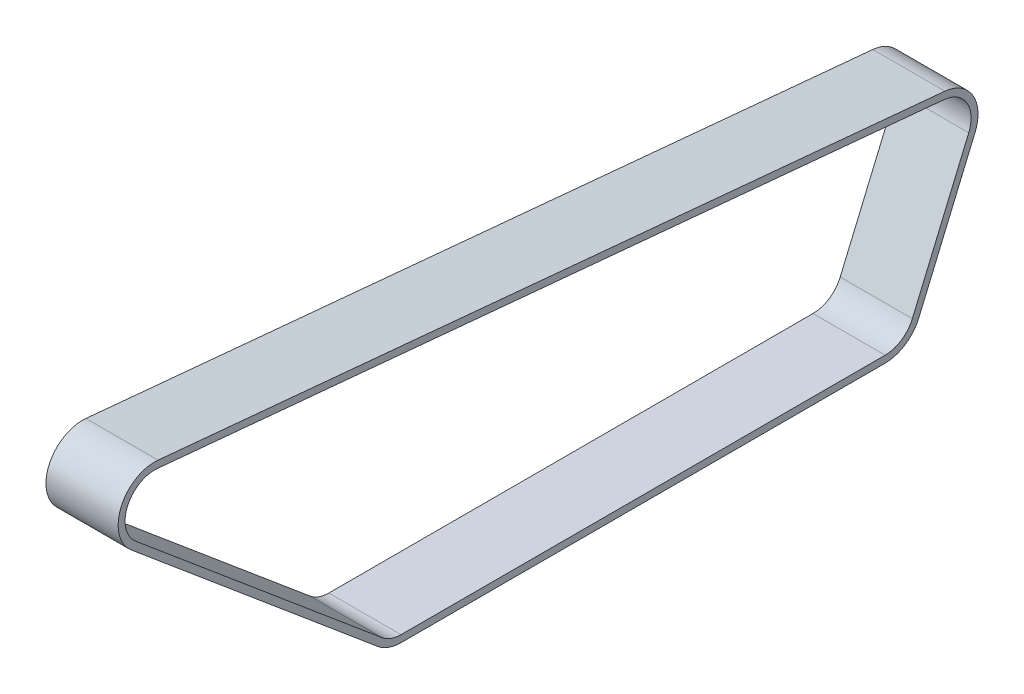
ISO-10303-21;
HEADER;
FILE_DESCRIPTION(('STEP AP214'),'2;1');
FILE_NAME('part.step','',(''),(''),'','','');
FILE_SCHEMA(('AUTOMOTIVE_DESIGN { 1 0 10303 214 1 1 1 1 }'));
ENDSEC;
DATA;
#1=APPLICATION_CONTEXT('core data for automotive mechanical design processes');
#2=APPLICATION_PROTOCOL_DEFINITION('international standard','automotive_design',2000,#1);
#3=PRODUCT_CONTEXT('',#1,'mechanical');
#4=PRODUCT('Part','Part','',(#3));
#5=PRODUCT_RELATED_PRODUCT_CATEGORY('part','',(#4));
#6=PRODUCT_DEFINITION_FORMATION('','',#4);
#7=PRODUCT_DEFINITION_CONTEXT('part definition',#1,'design');
#8=PRODUCT_DEFINITION('design','',#6,#7);
#9=PRODUCT_DEFINITION_SHAPE('','',#8);
#10=(LENGTH_UNIT() NAMED_UNIT(*) SI_UNIT(.MILLI.,.METRE.));
#11=(NAMED_UNIT(*) PLANE_ANGLE_UNIT() SI_UNIT($,.RADIAN.));
#12=(NAMED_UNIT(*) SI_UNIT($,.STERADIAN.) SOLID_ANGLE_UNIT());
#13=UNCERTAINTY_MEASURE_WITH_UNIT(LENGTH_MEASURE(1.E-05),#10,'distance_accuracy_value','');
#14=(GEOMETRIC_REPRESENTATION_CONTEXT(3) GLOBAL_UNCERTAINTY_ASSIGNED_CONTEXT((#13)) GLOBAL_UNIT_ASSIGNED_CONTEXT((#10,
#11,#12)) REPRESENTATION_CONTEXT('',''));
#15=CARTESIAN_POINT('',(0.,0.,0.));
#16=DIRECTION('',(0.,0.,1.));
#17=DIRECTION('',(1.,0.,0.));
#18=AXIS2_PLACEMENT_3D('',#15,#16,#17);
#19=CARTESIAN_POINT('',(3.,21.,132.35662508041));
#20=DIRECTION('',(-1.,0.,0.));
#21=DIRECTION('',(0.,0.,1.));
#22=AXIS2_PLACEMENT_3D('',#19,#20,#21);
#23=CYLINDRICAL_SURFACE('',#22,21.);
#24=CARTESIAN_POINT('',(0.,21.,132.35662508041));
#25=DIRECTION('',(1.,0.,0.));
#26=DIRECTION('',(0.,0.,1.));
#27=AXIS2_PLACEMENT_3D('',#24,#25,#26);
#28=CIRCLE('',#27,21.);
#29=CARTESIAN_POINT('',(0.,4.91306669450143,145.855164883827));
#30=VERTEX_POINT('',#29);
#31=CARTESIAN_POINT('',(0.,0.,132.35662508041));
#32=VERTEX_POINT('',#31);
#33=EDGE_CURVE('E238',#30,#32,#28,.T.);
#34=ORIENTED_EDGE('',*,*,#33,.T.);
#35=DIRECTION('',(-1.,0.,0.));
#36=VECTOR('',#35,1.);
#37=CARTESIAN_POINT('',(3.,0.,132.35662508041));
#38=LINE('',#37,#36);
#39=CARTESIAN_POINT('',(41.5,0.,132.35662508041));
#40=VERTEX_POINT('',#39);
#41=EDGE_CURVE('E11',#40,#32,#38,.T.);
#42=ORIENTED_EDGE('',*,*,#41,.F.);
#43=CARTESIAN_POINT('',(41.5,21.0000000000001,132.35662508041));
#44=DIRECTION('',(1.,0.,0.));
#45=DIRECTION('',(0.,0.,-1.));
#46=AXIS2_PLACEMENT_3D('',#43,#44,#45);
#47=CIRCLE('',#46,21.0000000000001);
#48=CARTESIAN_POINT('',(41.5,4.91306669450144,145.855164883827));
#49=VERTEX_POINT('',#48);
#50=EDGE_CURVE('E220',#49,#40,#47,.T.);
#51=ORIENTED_EDGE('',*,*,#50,.F.);
#52=DIRECTION('',(-1.,0.,0.));
#53=VECTOR('',#52,1.);
#54=CARTESIAN_POINT('',(3.,4.91306669450143,145.855164883827));
#55=LINE('',#54,#53);
#56=EDGE_CURVE('E254',#49,#30,#55,.T.);
#57=ORIENTED_EDGE('',*,*,#56,.T.);
#58=EDGE_LOOP('',(#34,#42,#51,#57));
#59=FACE_BOUND('',#58,.T.);
#60=ADVANCED_FACE('F34',(#59),#23,.T.);
#61=CARTESIAN_POINT('',(3.,0.,132.35662508041));
#62=DIRECTION('',(0.,1.,0.));
#63=DIRECTION('',(0.,0.,1.));
#64=AXIS2_PLACEMENT_3D('',#61,#62,#63);
#65=PLANE('',#64);
#66=DIRECTION('',(0.,0.,-1.));
#67=VECTOR('',#66,1.);
#68=CARTESIAN_POINT('',(0.,0.,132.35662508041));
#69=LINE('',#68,#67);
#70=CARTESIAN_POINT('',(0.,0.,-146.10040321489));
#71=VERTEX_POINT('',#70);
#72=EDGE_CURVE('E241',#32,#71,#69,.T.);
#73=ORIENTED_EDGE('',*,*,#72,.T.);
#74=DIRECTION('',(-1.,0.,0.));
#75=VECTOR('',#74,1.);
#76=CARTESIAN_POINT('',(3.,0.,-146.10040321489));
#77=LINE('',#76,#75);
#78=CARTESIAN_POINT('',(41.5,0.,-146.10040321489));
#79=VERTEX_POINT('',#78);
#80=EDGE_CURVE('E41',#79,#71,#77,.T.);
#81=ORIENTED_EDGE('',*,*,#80,.F.);
#82=DIRECTION('',(0.,0.,-1.));
#83=VECTOR('',#82,1.);
#84=CARTESIAN_POINT('',(41.5,0.,-146.10040321489));
#85=LINE('',#84,#83);
#86=EDGE_CURVE('E223',#40,#79,#85,.T.);
#87=ORIENTED_EDGE('',*,*,#86,.F.);
#88=ORIENTED_EDGE('',*,*,#41,.T.);
#89=EDGE_LOOP('',(#73,#81,#87,#88));
#90=FACE_BOUND('',#89,.T.);
#91=ADVANCED_FACE('F300',(#90),#65,.F.);
#92=CARTESIAN_POINT('',(3.,21.,-146.10040321489));
#93=DIRECTION('',(-1.,0.,0.));
#94=DIRECTION('',(0.,0.,1.));
#95=AXIS2_PLACEMENT_3D('',#92,#93,#94);
#96=CYLINDRICAL_SURFACE('',#95,21.);
#97=CARTESIAN_POINT('',(0.,21.,-146.10040321489));
#98=DIRECTION('',(1.,0.,0.));
#99=DIRECTION('',(0.,0.,-1.));
#100=AXIS2_PLACEMENT_3D('',#97,#98,#99);
#101=CIRCLE('',#100,21.);
#102=CARTESIAN_POINT('',(0.,12.7946463017253,-165.431005137392));
#103=VERTEX_POINT('',#102);
#104=EDGE_CURVE('E243',#71,#103,#101,.T.);
#105=ORIENTED_EDGE('',*,*,#104,.T.);
#106=DIRECTION('',(-1.,0.,0.));
#107=VECTOR('',#106,1.);
#108=CARTESIAN_POINT('',(3.,12.7946463017253,-165.431005137392));
#109=LINE('',#108,#107);
#110=CARTESIAN_POINT('',(41.5,12.7946463017253,-165.431005137392));
#111=VERTEX_POINT('',#110);
#112=EDGE_CURVE('E267',#111,#103,#109,.T.);
#113=ORIENTED_EDGE('',*,*,#112,.F.);
#114=CARTESIAN_POINT('',(41.5,21.,-146.10040321489));
#115=DIRECTION('',(1.,0.,0.));
#116=DIRECTION('',(0.,0.,1.));
#117=AXIS2_PLACEMENT_3D('',#114,#115,#116);
#118=CIRCLE('',#117,21.);
#119=EDGE_CURVE('E226',#79,#111,#118,.T.);
#120=ORIENTED_EDGE('',*,*,#119,.F.);
#121=ORIENTED_EDGE('',*,*,#80,.T.);
#122=EDGE_LOOP('',(#105,#113,#120,#121));
#123=FACE_BOUND('',#122,.T.);
#124=ADVANCED_FACE('F273',(#123),#96,.T.);
#125=CARTESIAN_POINT('',(3.,12.7946463017253,-165.431005137392));
#126=DIRECTION('',(0.,0.390731128489271,0.920504853452441));
#127=DIRECTION('',(0.,-0.920504853452441,0.390731128489271));
#128=AXIS2_PLACEMENT_3D('',#125,#126,#127);
#129=PLANE('',#128);
#130=DIRECTION('',(0.,0.920504853452441,-0.390731128489271));
#131=VECTOR('',#130,1.);
#132=CARTESIAN_POINT('',(0.,12.7946463017253,-165.431005137392));
#133=LINE('',#132,#131);
#134=CARTESIAN_POINT('',(0.,89.1965491382779,-197.861688802001));
#135=VERTEX_POINT('',#134);
#136=EDGE_CURVE('E245',#103,#135,#133,.T.);
#137=ORIENTED_EDGE('',*,*,#136,.T.);
#138=DIRECTION('',(-1.,0.,0.));
#139=VECTOR('',#138,1.);
#140=CARTESIAN_POINT('',(3.,89.1965491382779,-197.861688802001));
#141=LINE('',#140,#139);
#142=CARTESIAN_POINT('',(41.5,89.196549138278,-197.861688802001));
#143=VERTEX_POINT('',#142);
#144=EDGE_CURVE('E264',#143,#135,#141,.T.);
#145=ORIENTED_EDGE('',*,*,#144,.F.);
#146=DIRECTION('',(0.,0.920504853452441,-0.390731128489271));
#147=VECTOR('',#146,1.);
#148=CARTESIAN_POINT('',(41.5,89.1965491382779,-197.861688802001));
#149=LINE('',#148,#147);
#150=EDGE_CURVE('E229',#111,#143,#149,.T.);
#151=ORIENTED_EDGE('',*,*,#150,.F.);
#152=ORIENTED_EDGE('',*,*,#112,.T.);
#153=EDGE_LOOP('',(#137,#145,#151,#152));
#154=FACE_BOUND('',#153,.T.);
#155=ADVANCED_FACE('F281',(#154),#129,.F.);
#156=CARTESIAN_POINT('',(3.,97.4019028365527,-178.5310868795));
#157=DIRECTION('',(-1.,0.,0.));
#158=DIRECTION('',(0.,0.,1.));
#159=AXIS2_PLACEMENT_3D('',#156,#157,#158);
#160=CYLINDRICAL_SURFACE('',#159,21.);
#161=CARTESIAN_POINT('',(0.,97.4019028365527,-178.5310868795));
#162=DIRECTION('',(1.,0.,0.));
#163=DIRECTION('',(0.,0.,-1.));
#164=AXIS2_PLACEMENT_3D('',#161,#162,#163);
#165=CIRCLE('',#164,21.);
#166=CARTESIAN_POINT('',(0.,118.309861650224,-180.495077267927));
#167=VERTEX_POINT('',#166);
#168=EDGE_CURVE('E247',#135,#167,#165,.T.);
#169=ORIENTED_EDGE('',*,*,#168,.T.);
#170=DIRECTION('',(-1.,0.,0.));
#171=VECTOR('',#170,1.);
#172=CARTESIAN_POINT('',(3.,118.309861650224,-180.495077267927));
#173=LINE('',#172,#171);
#174=CARTESIAN_POINT('',(41.5,118.309861650224,-180.495077267927));
#175=VERTEX_POINT('',#174);
#176=EDGE_CURVE('E261',#175,#167,#173,.T.);
#177=ORIENTED_EDGE('',*,*,#176,.F.);
#178=CARTESIAN_POINT('',(41.5,97.4019028365526,-178.5310868795));
#179=DIRECTION('',(1.,0.,0.));
#180=DIRECTION('',(0.,0.,1.));
#181=AXIS2_PLACEMENT_3D('',#178,#179,#180);
#182=CIRCLE('',#181,21.);
#183=EDGE_CURVE('E232',#143,#175,#182,.T.);
#184=ORIENTED_EDGE('',*,*,#183,.F.);
#185=ORIENTED_EDGE('',*,*,#144,.T.);
#186=EDGE_LOOP('',(#169,#177,#184,#185));
#187=FACE_BOUND('',#186,.T.);
#188=ADVANCED_FACE('F285',(#187),#160,.T.);
#189=CARTESIAN_POINT('',(3.,160.825649707406,272.113220037601));
#190=DIRECTION('',(0.,-0.99561708636529,0.0935233518298539));
#191=DIRECTION('',(0.,-0.093523351829854,-0.99561708636529));
#192=AXIS2_PLACEMENT_3D('',#189,#190,#191);
#193=PLANE('',#192);
#194=DIRECTION('',(0.,0.093523351829854,0.99561708636529));
#195=VECTOR('',#194,1.);
#196=CARTESIAN_POINT('',(0.,160.825649707406,272.113220037601));
#197=LINE('',#196,#195);
#198=CARTESIAN_POINT('',(0.,160.825649707406,272.113220037601));
#199=VERTEX_POINT('',#198);
#200=EDGE_CURVE('E249',#167,#199,#197,.T.);
#201=ORIENTED_EDGE('',*,*,#200,.T.);
#202=DIRECTION('',(-1.,0.,0.));
#203=VECTOR('',#202,1.);
#204=CARTESIAN_POINT('',(3.,160.825649707406,272.113220037601));
#205=LINE('',#204,#203);
#206=CARTESIAN_POINT('',(41.5,160.825649707406,272.113220037601));
#207=VERTEX_POINT('',#206);
#208=EDGE_CURVE('E258',#207,#199,#205,.T.);
#209=ORIENTED_EDGE('',*,*,#208,.F.);
#210=DIRECTION('',(0.,0.093523351829854,0.99561708636529));
#211=VECTOR('',#210,1.);
#212=CARTESIAN_POINT('',(41.5,160.825649707406,272.113220037601));
#213=LINE('',#212,#211);
#214=EDGE_CURVE('E235',#175,#207,#213,.T.);
#215=ORIENTED_EDGE('',*,*,#214,.F.);
#216=ORIENTED_EDGE('',*,*,#176,.T.);
#217=EDGE_LOOP('',(#201,#209,#215,#216));
#218=FACE_BOUND('',#217,.T.);
#219=ADVANCED_FACE('F292',(#218),#193,.F.);
#220=CARTESIAN_POINT('',(3.,139.917690893735,274.077210426028));
#221=DIRECTION('',(-1.,0.,0.));
#222=DIRECTION('',(0.,0.,1.));
#223=AXIS2_PLACEMENT_3D('',#220,#221,#222);
#224=CYLINDRICAL_SURFACE('',#223,21.);
#225=CARTESIAN_POINT('',(0.,139.917690893735,274.077210426028));
#226=DIRECTION('',(1.,0.,0.));
#227=DIRECTION('',(0.,0.,1.));
#228=AXIS2_PLACEMENT_3D('',#225,#226,#227);
#229=CIRCLE('',#228,21.);
#230=CARTESIAN_POINT('',(0.,123.830757588236,287.575750229445));
#231=VERTEX_POINT('',#230);
#232=EDGE_CURVE('E251',#199,#231,#229,.T.);
#233=ORIENTED_EDGE('',*,*,#232,.T.);
#234=DIRECTION('',(-1.,0.,0.));
#235=VECTOR('',#234,1.);
#236=CARTESIAN_POINT('',(3.,123.830757588236,287.575750229445));
#237=LINE('',#236,#235);
#238=CARTESIAN_POINT('',(41.5,123.830757588236,287.575750229445));
#239=VERTEX_POINT('',#238);
#240=EDGE_CURVE('E256',#239,#231,#237,.T.);
#241=ORIENTED_EDGE('',*,*,#240,.F.);
#242=CARTESIAN_POINT('',(41.5,139.917690893735,274.077210426028));
#243=DIRECTION('',(1.,0.,0.));
#244=DIRECTION('',(0.,0.,1.));
#245=AXIS2_PLACEMENT_3D('',#242,#243,#244);
#246=CIRCLE('',#245,21.);
#247=EDGE_CURVE('E157',#207,#239,#246,.T.);
#248=ORIENTED_EDGE('',*,*,#247,.F.);
#249=ORIENTED_EDGE('',*,*,#208,.T.);
#250=EDGE_LOOP('',(#233,#241,#248,#249));
#251=FACE_BOUND('',#250,.T.);
#252=ADVANCED_FACE('F295',(#251),#224,.T.);
#253=CARTESIAN_POINT('',(3.,4.91306669450143,145.855164883827));
#254=DIRECTION('',(0.,0.766044443118982,-0.642787609686534));
#255=DIRECTION('',(0.,0.642787609686534,0.766044443118982));
#256=AXIS2_PLACEMENT_3D('',#253,#254,#255);
#257=PLANE('',#256);
#258=DIRECTION('',(0.,-0.642787609686534,-0.766044443118982));
#259=VECTOR('',#258,1.);
#260=CARTESIAN_POINT('',(0.,4.91306669450143,145.855164883827));
#261=LINE('',#260,#259);
#262=EDGE_CURVE('E56',#231,#30,#261,.T.);
#263=ORIENTED_EDGE('',*,*,#262,.T.);
#264=ORIENTED_EDGE('',*,*,#56,.F.);
#265=DIRECTION('',(0.,-0.642787609686534,-0.766044443118982));
#266=VECTOR('',#265,1.);
#267=CARTESIAN_POINT('',(41.5,4.91306669450143,145.855164883827));
#268=LINE('',#267,#266);
#269=EDGE_CURVE('E217',#239,#49,#268,.T.);
#270=ORIENTED_EDGE('',*,*,#269,.F.);
#271=ORIENTED_EDGE('',*,*,#240,.T.);
#272=EDGE_LOOP('',(#263,#264,#270,#271));
#273=FACE_BOUND('',#272,.T.);
#274=ADVANCED_FACE('F299',(#273),#257,.F.);
#275=CARTESIAN_POINT('',(0.,21.,132.35662508041));
#276=DIRECTION('',(-1.,0.,0.));
#277=DIRECTION('',(0.,0.,1.));
#278=AXIS2_PLACEMENT_3D('',#275,#276,#277);
#279=PLANE('',#278);
#280=CARTESIAN_POINT('',(0.,139.917690893735,274.077210426028));
#281=DIRECTION('',(1.,0.,0.));
#282=DIRECTION('',(0.,0.,1.));
#283=AXIS2_PLACEMENT_3D('',#280,#281,#282);
#284=CIRCLE('',#283,17.);
#285=CARTESIAN_POINT('',(0.,156.843181361945,272.487313444921));
#286=VERTEX_POINT('',#285);
#287=CARTESIAN_POINT('',(0.,126.894935360712,285.004599790699));
#288=VERTEX_POINT('',#287);
#289=EDGE_CURVE('E152',#286,#288,#284,.T.);
#290=ORIENTED_EDGE('',*,*,#289,.T.);
#291=DIRECTION('',(0.,-0.642787609686534,-0.766044443118982));
#292=VECTOR('',#291,1.);
#293=CARTESIAN_POINT('',(0.,7.97724446697736,143.284014445081));
#294=LINE('',#293,#292);
#295=CARTESIAN_POINT('',(0.,7.97724446697737,143.284014445081));
#296=VERTEX_POINT('',#295);
#297=EDGE_CURVE('E160',#288,#296,#294,.T.);
#298=ORIENTED_EDGE('',*,*,#297,.T.);
#299=CARTESIAN_POINT('',(0.,21.0000000000002,132.35662508041));
#300=DIRECTION('',(1.,0.,0.));
#301=DIRECTION('',(0.,0.,-1.));
#302=AXIS2_PLACEMENT_3D('',#299,#300,#301);
#303=CIRCLE('',#302,17.0000000000002);
#304=CARTESIAN_POINT('',(0.,4.,132.35662508041));
#305=VERTEX_POINT('',#304);
#306=EDGE_CURVE('E164',#296,#305,#303,.T.);
#307=ORIENTED_EDGE('',*,*,#306,.T.);
#308=DIRECTION('',(0.,0.,-1.));
#309=VECTOR('',#308,1.);
#310=CARTESIAN_POINT('',(0.,4.,-146.10040321489));
#311=LINE('',#310,#309);
#312=CARTESIAN_POINT('',(0.,4.,-146.10040321489));
#313=VERTEX_POINT('',#312);
#314=EDGE_CURVE('E174',#305,#313,#311,.T.);
#315=ORIENTED_EDGE('',*,*,#314,.T.);
#316=CARTESIAN_POINT('',(0.,21.,-146.10040321489));
#317=DIRECTION('',(1.,0.,0.));
#318=DIRECTION('',(0.,0.,1.));
#319=AXIS2_PLACEMENT_3D('',#316,#317,#318);
#320=CIRCLE('',#319,17.);
#321=CARTESIAN_POINT('',(0.,14.3575708156824,-161.748985723582));
#322=VERTEX_POINT('',#321);
#323=EDGE_CURVE('E177',#313,#322,#320,.T.);
#324=ORIENTED_EDGE('',*,*,#323,.T.);
#325=DIRECTION('',(0.,0.920504853452441,-0.390731128489271));
#326=VECTOR('',#325,1.);
#327=CARTESIAN_POINT('',(0.,90.759473652235,-194.179669388191));
#328=LINE('',#327,#326);
#329=CARTESIAN_POINT('',(0.,90.759473652235,-194.179669388191));
#330=VERTEX_POINT('',#329);
#331=EDGE_CURVE('E180',#322,#330,#328,.T.);
#332=ORIENTED_EDGE('',*,*,#331,.T.);
#333=CARTESIAN_POINT('',(0.,97.4019028365527,-178.5310868795));
#334=DIRECTION('',(1.,0.,0.));
#335=DIRECTION('',(0.,0.,1.));
#336=AXIS2_PLACEMENT_3D('',#333,#334,#335);
#337=CIRCLE('',#336,17.);
#338=CARTESIAN_POINT('',(0.,114.327393304763,-180.120983860608));
#339=VERTEX_POINT('',#338);
#340=EDGE_CURVE('E183',#330,#339,#337,.T.);
#341=ORIENTED_EDGE('',*,*,#340,.T.);
#342=DIRECTION('',(0.,0.093523351829854,0.99561708636529));
#343=VECTOR('',#342,1.);
#344=CARTESIAN_POINT('',(0.,156.843181361945,272.487313444921));
#345=LINE('',#344,#343);
#346=EDGE_CURVE('E170',#339,#286,#345,.T.);
#347=ORIENTED_EDGE('',*,*,#346,.T.);
#348=EDGE_LOOP('',(#290,#298,#307,#315,#324,#332,#341,#347));
#349=FACE_BOUND('',#348,.T.);
#350=ORIENTED_EDGE('',*,*,#33,.F.);
#351=ORIENTED_EDGE('',*,*,#262,.F.);
#352=ORIENTED_EDGE('',*,*,#232,.F.);
#353=ORIENTED_EDGE('',*,*,#200,.F.);
#354=ORIENTED_EDGE('',*,*,#168,.F.);
#355=ORIENTED_EDGE('',*,*,#136,.F.);
#356=ORIENTED_EDGE('',*,*,#104,.F.);
#357=ORIENTED_EDGE('',*,*,#72,.F.);
#358=EDGE_LOOP('',(#350,#351,#352,#353,#354,#355,#356,#357));
#359=FACE_BOUND('',#358,.T.);
#360=ADVANCED_FACE('F166',(#349,#359),#279,.T.);
#361=CARTESIAN_POINT('',(41.5,139.917690893735,274.077210426028));
#362=DIRECTION('',(-1.,0.,0.));
#363=DIRECTION('',(0.,0.,1.));
#364=AXIS2_PLACEMENT_3D('',#361,#362,#363);
#365=PLANE('',#364);
#366=ORIENTED_EDGE('',*,*,#247,.T.);
#367=ORIENTED_EDGE('',*,*,#269,.T.);
#368=ORIENTED_EDGE('',*,*,#50,.T.);
#369=ORIENTED_EDGE('',*,*,#86,.T.);
#370=ORIENTED_EDGE('',*,*,#119,.T.);
#371=ORIENTED_EDGE('',*,*,#150,.T.);
#372=ORIENTED_EDGE('',*,*,#183,.T.);
#373=ORIENTED_EDGE('',*,*,#214,.T.);
#374=EDGE_LOOP('',(#366,#367,#368,#369,#370,#371,#372,#373));
#375=FACE_BOUND('',#374,.T.);
#376=CARTESIAN_POINT('',(41.5,139.917690893735,274.077210426028));
#377=DIRECTION('',(1.,0.,0.));
#378=DIRECTION('',(0.,0.,1.));
#379=AXIS2_PLACEMENT_3D('',#376,#377,#378);
#380=CIRCLE('',#379,17.);
#381=CARTESIAN_POINT('',(41.5,156.843181361945,272.487313444921));
#382=VERTEX_POINT('',#381);
#383=CARTESIAN_POINT('',(41.5,126.894935360712,285.004599790699));
#384=VERTEX_POINT('',#383);
#385=EDGE_CURVE('E155',#382,#384,#380,.T.);
#386=ORIENTED_EDGE('',*,*,#385,.F.);
#387=DIRECTION('',(0.,0.093523351829854,0.99561708636529));
#388=VECTOR('',#387,1.);
#389=CARTESIAN_POINT('',(41.5,156.843181361945,272.487313444921));
#390=LINE('',#389,#388);
#391=CARTESIAN_POINT('',(41.5,114.327393304763,-180.120983860608));
#392=VERTEX_POINT('',#391);
#393=EDGE_CURVE('E200',#392,#382,#390,.T.);
#394=ORIENTED_EDGE('',*,*,#393,.F.);
#395=CARTESIAN_POINT('',(41.5,97.4019028365526,-178.5310868795));
#396=DIRECTION('',(1.,0.,0.));
#397=DIRECTION('',(0.,0.,1.));
#398=AXIS2_PLACEMENT_3D('',#395,#396,#397);
#399=CIRCLE('',#398,17.);
#400=CARTESIAN_POINT('',(41.5,90.759473652235,-194.179669388191));
#401=VERTEX_POINT('',#400);
#402=EDGE_CURVE('E197',#401,#392,#399,.T.);
#403=ORIENTED_EDGE('',*,*,#402,.F.);
#404=DIRECTION('',(0.,0.920504853452441,-0.390731128489271));
#405=VECTOR('',#404,1.);
#406=CARTESIAN_POINT('',(41.5,90.759473652235,-194.179669388191));
#407=LINE('',#406,#405);
#408=CARTESIAN_POINT('',(41.5,14.3575708156824,-161.748985723582));
#409=VERTEX_POINT('',#408);
#410=EDGE_CURVE('E195',#409,#401,#407,.T.);
#411=ORIENTED_EDGE('',*,*,#410,.F.);
#412=CARTESIAN_POINT('',(41.5,21.,-146.10040321489));
#413=DIRECTION('',(1.,0.,0.));
#414=DIRECTION('',(0.,0.,1.));
#415=AXIS2_PLACEMENT_3D('',#412,#413,#414);
#416=CIRCLE('',#415,17.);
#417=CARTESIAN_POINT('',(41.5,4.,-146.10040321489));
#418=VERTEX_POINT('',#417);
#419=EDGE_CURVE('E193',#418,#409,#416,.T.);
#420=ORIENTED_EDGE('',*,*,#419,.F.);
#421=DIRECTION('',(0.,0.,-1.));
#422=VECTOR('',#421,1.);
#423=CARTESIAN_POINT('',(41.5,3.99999999999999,-146.10040321489));
#424=LINE('',#423,#422);
#425=CARTESIAN_POINT('',(41.5,4.,132.35662508041));
#426=VERTEX_POINT('',#425);
#427=EDGE_CURVE('E191',#426,#418,#424,.T.);
#428=ORIENTED_EDGE('',*,*,#427,.F.);
#429=CARTESIAN_POINT('',(41.5,21.0000000000001,132.35662508041));
#430=DIRECTION('',(1.,0.,0.));
#431=DIRECTION('',(0.,0.,-1.));
#432=AXIS2_PLACEMENT_3D('',#429,#430,#431);
#433=CIRCLE('',#432,17.0000000000001);
#434=CARTESIAN_POINT('',(41.5,7.97724446697736,143.284014445081));
#435=VERTEX_POINT('',#434);
#436=EDGE_CURVE('E189',#435,#426,#433,.T.);
#437=ORIENTED_EDGE('',*,*,#436,.F.);
#438=DIRECTION('',(0.,-0.642787609686534,-0.766044443118982));
#439=VECTOR('',#438,1.);
#440=CARTESIAN_POINT('',(41.5,7.97724446697736,143.284014445081));
#441=LINE('',#440,#439);
#442=EDGE_CURVE('E187',#384,#435,#441,.T.);
#443=ORIENTED_EDGE('',*,*,#442,.F.);
#444=EDGE_LOOP('',(#386,#394,#403,#411,#420,#428,#437,#443));
#445=FACE_BOUND('',#444,.T.);
#446=ADVANCED_FACE('F288',(#375,#445),#365,.F.);
#447=CARTESIAN_POINT('',(41.5,139.917690893735,274.077210426028));
#448=DIRECTION('',(-1.,0.,0.));
#449=DIRECTION('',(0.,0.,1.));
#450=AXIS2_PLACEMENT_3D('',#447,#448,#449);
#451=CYLINDRICAL_SURFACE('',#450,17.);
#452=DIRECTION('',(-1.,0.,0.));
#453=VECTOR('',#452,1.);
#454=CARTESIAN_POINT('',(41.5,126.894935360712,285.004599790699));
#455=LINE('',#454,#453);
#456=EDGE_CURVE('E148',#384,#288,#455,.T.);
#457=ORIENTED_EDGE('',*,*,#456,.T.);
#458=ORIENTED_EDGE('',*,*,#289,.F.);
#459=DIRECTION('',(-1.,0.,0.));
#460=VECTOR('',#459,1.);
#461=CARTESIAN_POINT('',(41.5,156.843181361945,272.487313444921));
#462=LINE('',#461,#460);
#463=EDGE_CURVE('E202',#382,#286,#462,.T.);
#464=ORIENTED_EDGE('',*,*,#463,.F.);
#465=ORIENTED_EDGE('',*,*,#385,.T.);
#466=EDGE_LOOP('',(#457,#458,#464,#465));
#467=FACE_BOUND('',#466,.T.);
#468=ADVANCED_FACE('F149',(#467),#451,.F.);
#469=CARTESIAN_POINT('',(41.5,7.97724446697736,143.284014445081));
#470=DIRECTION('',(0.,0.766044443118982,-0.642787609686534));
#471=DIRECTION('',(0.,0.642787609686534,0.766044443118982));
#472=AXIS2_PLACEMENT_3D('',#469,#470,#471);
#473=PLANE('',#472);
#474=DIRECTION('',(-1.,0.,0.));
#475=VECTOR('',#474,1.);
#476=CARTESIAN_POINT('',(41.5,7.97724446697736,143.284014445081));
#477=LINE('',#476,#475);
#478=EDGE_CURVE('E48',#435,#296,#477,.T.);
#479=ORIENTED_EDGE('',*,*,#478,.T.);
#480=ORIENTED_EDGE('',*,*,#297,.F.);
#481=ORIENTED_EDGE('',*,*,#456,.F.);
#482=ORIENTED_EDGE('',*,*,#442,.T.);
#483=EDGE_LOOP('',(#479,#480,#481,#482));
#484=FACE_BOUND('',#483,.T.);
#485=ADVANCED_FACE('F161',(#484),#473,.T.);
#486=CARTESIAN_POINT('',(41.5,21.0000000000001,132.35662508041));
#487=DIRECTION('',(-1.,0.,0.));
#488=DIRECTION('',(0.,0.,1.));
#489=AXIS2_PLACEMENT_3D('',#486,#487,#488);
#490=CYLINDRICAL_SURFACE('',#489,17.0000000000001);
#491=DIRECTION('',(-1.,0.,0.));
#492=VECTOR('',#491,1.);
#493=CARTESIAN_POINT('',(41.5,4.,132.35662508041));
#494=LINE('',#493,#492);
#495=EDGE_CURVE('E212',#426,#305,#494,.T.);
#496=ORIENTED_EDGE('',*,*,#495,.T.);
#497=ORIENTED_EDGE('',*,*,#306,.F.);
#498=ORIENTED_EDGE('',*,*,#478,.F.);
#499=ORIENTED_EDGE('',*,*,#436,.T.);
#500=EDGE_LOOP('',(#496,#497,#498,#499));
#501=FACE_BOUND('',#500,.T.);
#502=ADVANCED_FACE('F326',(#501),#490,.F.);
#503=CARTESIAN_POINT('',(41.5,3.99999999999999,-146.10040321489));
#504=DIRECTION('',(0.,1.,0.));
#505=DIRECTION('',(0.,0.,1.));
#506=AXIS2_PLACEMENT_3D('',#503,#504,#505);
#507=PLANE('',#506);
#508=DIRECTION('',(-1.,0.,0.));
#509=VECTOR('',#508,1.);
#510=CARTESIAN_POINT('',(41.5,4.,-146.10040321489));
#511=LINE('',#510,#509);
#512=EDGE_CURVE('E210',#418,#313,#511,.T.);
#513=ORIENTED_EDGE('',*,*,#512,.T.);
#514=ORIENTED_EDGE('',*,*,#314,.F.);
#515=ORIENTED_EDGE('',*,*,#495,.F.);
#516=ORIENTED_EDGE('',*,*,#427,.T.);
#517=EDGE_LOOP('',(#513,#514,#515,#516));
#518=FACE_BOUND('',#517,.T.);
#519=ADVANCED_FACE('F329',(#518),#507,.T.);
#520=CARTESIAN_POINT('',(41.5,21.,-146.10040321489));
#521=DIRECTION('',(-1.,0.,0.));
#522=DIRECTION('',(0.,0.,1.));
#523=AXIS2_PLACEMENT_3D('',#520,#521,#522);
#524=CYLINDRICAL_SURFACE('',#523,17.);
#525=DIRECTION('',(-1.,0.,0.));
#526=VECTOR('',#525,1.);
#527=CARTESIAN_POINT('',(41.5,14.3575708156824,-161.748985723582));
#528=LINE('',#527,#526);
#529=EDGE_CURVE('E208',#409,#322,#528,.T.);
#530=ORIENTED_EDGE('',*,*,#529,.T.);
#531=ORIENTED_EDGE('',*,*,#323,.F.);
#532=ORIENTED_EDGE('',*,*,#512,.F.);
#533=ORIENTED_EDGE('',*,*,#419,.T.);
#534=EDGE_LOOP('',(#530,#531,#532,#533));
#535=FACE_BOUND('',#534,.T.);
#536=ADVANCED_FACE('F333',(#535),#524,.F.);
#537=CARTESIAN_POINT('',(41.5,90.759473652235,-194.179669388191));
#538=DIRECTION('',(0.,0.390731128489271,0.920504853452441));
#539=DIRECTION('',(0.,-0.920504853452441,0.390731128489271));
#540=AXIS2_PLACEMENT_3D('',#537,#538,#539);
#541=PLANE('',#540);
#542=DIRECTION('',(-1.,0.,0.));
#543=VECTOR('',#542,1.);
#544=CARTESIAN_POINT('',(41.5,90.759473652235,-194.179669388191));
#545=LINE('',#544,#543);
#546=EDGE_CURVE('E206',#401,#330,#545,.T.);
#547=ORIENTED_EDGE('',*,*,#546,.T.);
#548=ORIENTED_EDGE('',*,*,#331,.F.);
#549=ORIENTED_EDGE('',*,*,#529,.F.);
#550=ORIENTED_EDGE('',*,*,#410,.T.);
#551=EDGE_LOOP('',(#547,#548,#549,#550));
#552=FACE_BOUND('',#551,.T.);
#553=ADVANCED_FACE('F337',(#552),#541,.T.);
#554=CARTESIAN_POINT('',(41.5,97.4019028365526,-178.5310868795));
#555=DIRECTION('',(-1.,0.,0.));
#556=DIRECTION('',(0.,0.,1.));
#557=AXIS2_PLACEMENT_3D('',#554,#555,#556);
#558=CYLINDRICAL_SURFACE('',#557,17.);
#559=DIRECTION('',(-1.,0.,0.));
#560=VECTOR('',#559,1.);
#561=CARTESIAN_POINT('',(41.5,114.327393304763,-180.120983860608));
#562=LINE('',#561,#560);
#563=EDGE_CURVE('E204',#392,#339,#562,.T.);
#564=ORIENTED_EDGE('',*,*,#563,.T.);
#565=ORIENTED_EDGE('',*,*,#340,.F.);
#566=ORIENTED_EDGE('',*,*,#546,.F.);
#567=ORIENTED_EDGE('',*,*,#402,.T.);
#568=EDGE_LOOP('',(#564,#565,#566,#567));
#569=FACE_BOUND('',#568,.T.);
#570=ADVANCED_FACE('F341',(#569),#558,.F.);
#571=CARTESIAN_POINT('',(41.5,156.843181361945,272.487313444921));
#572=DIRECTION('',(0.,-0.99561708636529,0.093523351829854));
#573=DIRECTION('',(0.,-0.093523351829854,-0.99561708636529));
#574=AXIS2_PLACEMENT_3D('',#571,#572,#573);
#575=PLANE('',#574);
#576=ORIENTED_EDGE('',*,*,#463,.T.);
#577=ORIENTED_EDGE('',*,*,#346,.F.);
#578=ORIENTED_EDGE('',*,*,#563,.F.);
#579=ORIENTED_EDGE('',*,*,#393,.T.);
#580=EDGE_LOOP('',(#576,#577,#578,#579));
#581=FACE_BOUND('',#580,.T.);
#582=ADVANCED_FACE('F345',(#581),#575,.T.);
#583=CLOSED_SHELL('',(#60,#91,#124,#155,#188,#219,#252,#274,#360,#446,#468,#485,#502,#519,#536,
#553,#570,#582));
#584=MANIFOLD_SOLID_BREP('B2',#583);
#585=ADVANCED_BREP_SHAPE_REPRESENTATION('',(#18,#584),#14);
#586=SHAPE_DEFINITION_REPRESENTATION(#9,#585);
ENDSEC;
END-ISO-10303-21;
